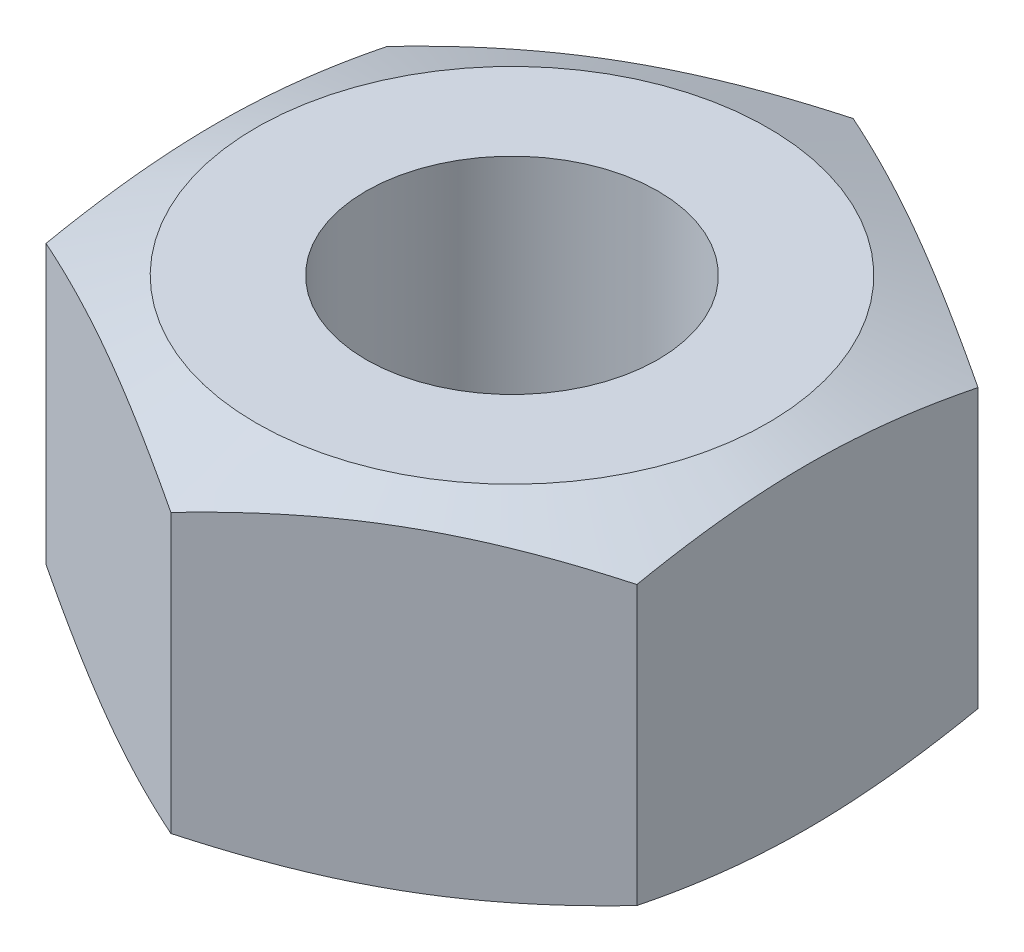
ISO-10303-21;
HEADER;
FILE_DESCRIPTION(('STEP AP214'),'2;1');
FILE_NAME('part.step','',(''),(''),'','','');
FILE_SCHEMA(('AUTOMOTIVE_DESIGN { 1 0 10303 214 1 1 1 1 }'));
ENDSEC;
DATA;
#1=APPLICATION_CONTEXT('core data for automotive mechanical design processes');
#2=APPLICATION_PROTOCOL_DEFINITION('international standard','automotive_design',2000,#1);
#3=PRODUCT_CONTEXT('',#1,'mechanical');
#4=PRODUCT('Part','Part','',(#3));
#5=PRODUCT_RELATED_PRODUCT_CATEGORY('part','',(#4));
#6=PRODUCT_DEFINITION_FORMATION('','',#4);
#7=PRODUCT_DEFINITION_CONTEXT('part definition',#1,'design');
#8=PRODUCT_DEFINITION('design','',#6,#7);
#9=PRODUCT_DEFINITION_SHAPE('','',#8);
#10=(LENGTH_UNIT() NAMED_UNIT(*) SI_UNIT(.MILLI.,.METRE.));
#11=(NAMED_UNIT(*) PLANE_ANGLE_UNIT() SI_UNIT($,.RADIAN.));
#12=(NAMED_UNIT(*) SI_UNIT($,.STERADIAN.) SOLID_ANGLE_UNIT());
#13=UNCERTAINTY_MEASURE_WITH_UNIT(LENGTH_MEASURE(1.E-05),#10,'distance_accuracy_value','');
#14=(GEOMETRIC_REPRESENTATION_CONTEXT(3) GLOBAL_UNCERTAINTY_ASSIGNED_CONTEXT((#13)) GLOBAL_UNIT_ASSIGNED_CONTEXT((#10,
#11,#12)) REPRESENTATION_CONTEXT('',''));
#15=CARTESIAN_POINT('',(0.,0.,0.));
#16=DIRECTION('',(0.,0.,1.));
#17=DIRECTION('',(1.,0.,0.));
#18=AXIS2_PLACEMENT_3D('',#15,#16,#17);
#19=CARTESIAN_POINT('',(0.,10.,0.));
#20=DIRECTION('',(0.,1.,0.));
#21=DIRECTION('',(0.,0.,1.));
#22=AXIS2_PLACEMENT_3D('',#19,#20,#21);
#23=PLANE('',#22);
#24=CARTESIAN_POINT('',(0.,10.,0.));
#25=DIRECTION('',(0.,1.,0.));
#26=DIRECTION('',(0.,0.,1.));
#27=AXIS2_PLACEMENT_3D('',#24,#25,#26);
#28=CIRCLE('',#27,4.2);
#29=CARTESIAN_POINT('',(0.,10.,4.2));
#30=VERTEX_POINT('',#29);
#31=EDGE_CURVE('E204',#30,#30,#28,.T.);
#32=ORIENTED_EDGE('',*,*,#31,.F.);
#33=EDGE_LOOP('',(#32));
#34=FACE_BOUND('',#33,.T.);
#35=CARTESIAN_POINT('',(0.,10.,0.));
#36=DIRECTION('',(0.,1.,0.));
#37=DIRECTION('',(0.,0.,1.));
#38=AXIS2_PLACEMENT_3D('',#35,#36,#37);
#39=CIRCLE('',#38,7.36121593216768);
#40=CARTESIAN_POINT('',(0.,10.,7.36121593216768));
#41=VERTEX_POINT('',#40);
#42=EDGE_CURVE('E244',#41,#41,#39,.T.);
#43=ORIENTED_EDGE('',*,*,#42,.T.);
#44=EDGE_LOOP('',(#43));
#45=FACE_BOUND('',#44,.T.);
#46=ADVANCED_FACE('F34',(#34,#45),#23,.T.);
#47=CARTESIAN_POINT('',(0.,0.,0.));
#48=DIRECTION('',(0.,1.,0.));
#49=DIRECTION('',(0.,0.,1.));
#50=AXIS2_PLACEMENT_3D('',#47,#48,#49);
#51=PLANE('',#50);
#52=CARTESIAN_POINT('',(0.,0.,0.));
#53=DIRECTION('',(0.,1.,0.));
#54=DIRECTION('',(0.,0.,1.));
#55=AXIS2_PLACEMENT_3D('',#52,#53,#54);
#56=CIRCLE('',#55,7.36121593216768);
#57=CARTESIAN_POINT('',(0.,0.,7.36121593216768));
#58=VERTEX_POINT('',#57);
#59=EDGE_CURVE('E108',#58,#58,#56,.T.);
#60=ORIENTED_EDGE('',*,*,#59,.F.);
#61=EDGE_LOOP('',(#60));
#62=FACE_BOUND('',#61,.T.);
#63=CARTESIAN_POINT('',(0.,0.,0.));
#64=DIRECTION('',(0.,1.,0.));
#65=DIRECTION('',(0.,0.,1.));
#66=AXIS2_PLACEMENT_3D('',#63,#64,#65);
#67=CIRCLE('',#66,4.2);
#68=CARTESIAN_POINT('',(0.,0.,4.2));
#69=VERTEX_POINT('',#68);
#70=EDGE_CURVE('E203',#69,#69,#67,.T.);
#71=ORIENTED_EDGE('',*,*,#70,.T.);
#72=EDGE_LOOP('',(#71));
#73=FACE_BOUND('',#72,.T.);
#74=ADVANCED_FACE('F234',(#62,#73),#51,.F.);
#75=CARTESIAN_POINT('',(0.,10.,0.));
#76=DIRECTION('',(0.,-1.,0.));
#77=DIRECTION('',(0.,0.,-1.));
#78=AXIS2_PLACEMENT_3D('',#75,#76,#77);
#79=CYLINDRICAL_SURFACE('',#78,4.2);
#80=ORIENTED_EDGE('',*,*,#31,.T.);
#81=EDGE_LOOP('',(#80));
#82=FACE_BOUND('',#81,.T.);
#83=ORIENTED_EDGE('',*,*,#70,.F.);
#84=EDGE_LOOP('',(#83));
#85=FACE_BOUND('',#84,.T.);
#86=ADVANCED_FACE('F138',(#82,#85),#79,.F.);
#87=CARTESIAN_POINT('',(0.,9.,0.));
#88=DIRECTION('',(0.,-1.,0.));
#89=DIRECTION('',(0.,0.,-1.));
#90=AXIS2_PLACEMENT_3D('',#87,#88,#89);
#91=CONICAL_SURFACE('',#90,9.81495457622363,1.18380572483131);
#92=ORIENTED_EDGE('',*,*,#42,.F.);
#93=EDGE_LOOP('',(#92));
#94=FACE_BOUND('',#93,.T.);
#95=CARTESIAN_POINT('',(-8.5002,8.99995294034603,-4.90736181805796));
#96=CARTESIAN_POINT('',(-8.20580195878942,9.06922887035066,-5.07733260639979));
#97=CARTESIAN_POINT('',(-7.91042568890246,9.13333560864877,-5.24786817533125));
#98=CARTESIAN_POINT('',(-7.317704581126,9.24927053537174,-5.59007586646036));
#99=CARTESIAN_POINT('',(-7.02035869750698,9.3010915554037,-5.76174859241023));
#100=CARTESIAN_POINT('',(-6.4240947440116,9.39041983407388,-6.10600174646886));
#101=CARTESIAN_POINT('',(-6.12517703336376,9.42793023046977,-6.27858196717694));
#102=CARTESIAN_POINT('',(-5.52620618349085,9.48692330235668,-6.6243979485878));
#103=CARTESIAN_POINT('',(-5.22615330654588,9.50840947707626,-6.7976335578631));
#104=CARTESIAN_POINT('',(-4.63065189291888,9.53402831778677,-7.14144645932345));
#105=CARTESIAN_POINT('',(-4.33521292155425,9.53845308535883,-7.31201822896993));
#106=CARTESIAN_POINT('',(-3.74448063948653,9.5305209166904,-7.65307767104073));
#107=CARTESIAN_POINT('',(-3.44918734347596,9.51816253884572,-7.82356533498233));
#108=CARTESIAN_POINT('',(-2.85964787389036,9.47732161660823,-8.16393610644548));
#109=CARTESIAN_POINT('',(-2.56540114280394,9.44884959817802,-8.3338195358464));
#110=CARTESIAN_POINT('',(-1.97829900561061,9.37715185322312,-8.67278311279677));
#111=CARTESIAN_POINT('',(-1.68544346542969,9.33392757892381,-8.8418633377539));
#112=CARTESIAN_POINT('',(-1.27695505725026,9.26438642632721,-9.07770423017713));
#113=CARTESIAN_POINT('',(-1.16060314150725,9.24352327314252,-9.14488004005209));
#114=CARTESIAN_POINT('',(-0.928189157489906,9.19985553530954,-9.27906431628794));
#115=CARTESIAN_POINT('',(-0.812127048196183,9.17705124356958,-9.34607280633138));
#116=CARTESIAN_POINT('',(-0.579860161078965,9.12953132955534,-9.48017215613235));
#117=CARTESIAN_POINT('',(-0.463656412995791,9.1048090242385,-9.54726242136901));
#118=CARTESIAN_POINT('',(-0.231520943678708,9.05364241756338,-9.68128589706769));
#119=CARTESIAN_POINT('',(-0.115589251774011,9.02719793865146,-9.74821909059647));
#120=CARTESIAN_POINT('',(0.000200000000001028,8.99995294034603,-9.81507004627746));
#121=B_SPLINE_CURVE_WITH_KNOTS('',3,(#95,#96,#97,#98,#99,#100,#101,#102,#103,#104,#105,#106,
#107,#108,#109,#110,#111,#112,#113,#114,#115,#116,#117,#118,#119,#120),.UNSPECIFIED.,.F.,.F.,(4,
2,2,2,2,2,2,2,2,2,2,2,4),(0.,1.04085766618028,2.08232115890739,3.12355616818027,
4.16456373508203,5.1876673690243,6.21085888898192,7.23338279661428,8.25580607508998,
8.6636824020447,9.0714972911848,9.48080315809633,9.89015129087441),.UNSPECIFIED.);
#122=CARTESIAN_POINT('',(-8.5,9.,-4.90747728811179));
#123=VERTEX_POINT('',#122);
#124=CARTESIAN_POINT('',(0.,9.,-9.81495457622363));
#125=VERTEX_POINT('',#124);
#126=EDGE_CURVE('E165',#123,#125,#121,.T.);
#127=ORIENTED_EDGE('',*,*,#126,.F.);
#128=CARTESIAN_POINT('',(-8.49999999999993,6.05378505757053,14.7734430127444));
#129=CARTESIAN_POINT('',(-8.49999999999993,6.14521584562109,14.514603711036));
#130=CARTESIAN_POINT('',(-8.49999999999993,6.23612126921899,14.2555788725807));
#131=CARTESIAN_POINT('',(-8.49999999999993,6.41672536779628,13.7371059369931));
#132=CARTESIAN_POINT('',(-8.49999999999993,6.50642403015864,13.4776578354672));
#133=CARTESIAN_POINT('',(-8.49999999999994,6.77350332564199,12.6985199757166));
#134=CARTESIAN_POINT('',(-8.49999999999994,6.9488360006149,12.1781248406069));
#135=CARTESIAN_POINT('',(-8.49999999999994,7.29392166145625,11.1301642988236));
#136=CARTESIAN_POINT('',(-8.49999999999994,7.46360840102153,10.6025769918672));
#137=CARTESIAN_POINT('',(-8.49999999999995,7.79321698073555,9.5443657322041));
#138=CARTESIAN_POINT('',(-8.49999999999995,7.95313922734329,9.01374190690326));
#139=CARTESIAN_POINT('',(-8.49999999999996,8.25523863798633,7.96426498654301));
#140=CARTESIAN_POINT('',(-8.49999999999996,8.39779870991229,7.44552316515777));
#141=CARTESIAN_POINT('',(-8.49999999999996,8.66599858479493,6.40359137594314));
#142=CARTESIAN_POINT('',(-8.49999999999996,8.79163697376346,5.88040104027126));
#143=CARTESIAN_POINT('',(-8.49999999999997,9.01959177083153,4.8309412257289));
#144=CARTESIAN_POINT('',(-8.49999999999997,9.1219964727881,4.3046914732316));
#145=CARTESIAN_POINT('',(-8.49999999999997,9.25320355777517,3.51164699878624));
#146=CARTESIAN_POINT('',(-8.49999999999997,9.29320505150899,3.24669528835192));
#147=CARTESIAN_POINT('',(-8.49999999999998,9.3648289565617,2.71566979972535));
#148=CARTESIAN_POINT('',(-8.49999999999998,9.39645208447984,2.4495961194737));
#149=CARTESIAN_POINT('',(-8.49999999999998,9.44665086965694,1.95443698666162));
#150=CARTESIAN_POINT('',(-8.49999999999998,9.46644272030804,1.72547480468039));
#151=CARTESIAN_POINT('',(-8.49999999999998,9.49883114027673,1.26705223029774));
#152=CARTESIAN_POINT('',(-8.49999999999998,9.51142817948858,1.0375918714151));
#153=CARTESIAN_POINT('',(-8.49999999999998,9.52913741126572,0.57839072972319));
#154=CARTESIAN_POINT('',(-8.49999999999998,9.53424993540711,0.348649959787915));
#155=CARTESIAN_POINT('',(-8.49999999999998,9.53686918928079,-0.110875414382304));
#156=CARTESIAN_POINT('',(-8.49999999999999,9.53437590476402,-0.340660018698564));
#157=CARTESIAN_POINT('',(-8.49999999999999,9.52183709853977,-0.800204063895981));
#158=CARTESIAN_POINT('',(-8.49999999999999,9.51178562888834,-1.0299633423507));
#159=CARTESIAN_POINT('',(-8.49999999999999,9.4843646278947,-1.48904913165291));
#160=CARTESIAN_POINT('',(-8.49999999999999,9.46699468461044,-1.71837561740939));
#161=CARTESIAN_POINT('',(-8.49999999999999,9.40445269772442,-2.40542350966656));
#162=CARTESIAN_POINT('',(-8.49999999999999,9.34884830384325,-2.86221976506699));
#163=CARTESIAN_POINT('',(-8.5,9.21387840947045,-3.77333313769236));
#164=CARTESIAN_POINT('',(-8.5,9.13445419010336,-4.22764127022451));
#165=CARTESIAN_POINT('',(-8.5,8.95659979067783,-5.13247184583842));
#166=CARTESIAN_POINT('',(-8.5,8.85816942848621,-5.58299425259893));
#167=CARTESIAN_POINT('',(-8.50000000000001,8.64643917601778,-6.48073760967403));
#168=CARTESIAN_POINT('',(-8.50000000000001,8.53313144807001,-6.92795668763914));
#169=CARTESIAN_POINT('',(-8.50000000000001,8.29508979616584,-7.81930356830697));
#170=CARTESIAN_POINT('',(-8.50000000000001,8.17035618963224,-8.26343145651755));
#171=CARTESIAN_POINT('',(-8.50000000000002,7.89161685995063,-9.21931172084533));
#172=CARTESIAN_POINT('',(-8.50000000000002,7.73610543886846,-9.7306226380255));
#173=CARTESIAN_POINT('',(-8.50000000000002,7.41637412474504,-10.7501886078263));
#174=CARTESIAN_POINT('',(-8.50000000000002,7.25215904372827,-11.2584451795671));
#175=CARTESIAN_POINT('',(-8.50000000000003,6.91842727484483,-12.2686772067257));
#176=CARTESIAN_POINT('',(-8.50000000000003,6.74896383001152,-12.7706703070888));
#177=CARTESIAN_POINT('',(-8.50000000000003,6.4909486294176,-13.5224754793111));
#178=CARTESIAN_POINT('',(-8.50000000000003,6.40428594474223,-13.7729388782824));
#179=CARTESIAN_POINT('',(-8.50000000000004,6.22984055986733,-14.2734735375754));
#180=CARTESIAN_POINT('',(-8.50000000000004,6.14205786729078,-14.5235448005531));
#181=CARTESIAN_POINT('',(-8.50000000000004,6.05378505757053,-14.7734430127443));
#182=B_SPLINE_CURVE_WITH_KNOTS('',3,(#128,#129,#130,#131,#132,#133,#134,#135,#136,#137,#138,
#139,#140,#141,#142,#143,#144,#145,#146,#147,#148,#149,#150,#151,#152,#153,#154,#155,#156,#157,
#158,#159,#160,#161,#162,#163,#164,#165,#166,#167,#168,#169,#170,#171,#172,#173,#174,#175,#176,
#177,#178,#179,#180,#181),.UNSPECIFIED.,.F.,.F.,(4,2,2,2,2,2,2,2,2,2,2,2,2,2,2,2,2,2,2,2,2,2,2,
2,2,2,4),(0.,0.823537864589147,1.64708433281094,3.2944579297063,4.95700101921851,
6.6194748560861,8.23318484576412,9.84702959467592,11.4546345796927,12.258388335858,
13.0620733249839,13.7514169274446,14.4407155036172,15.129983541825,15.8192528713383,
16.5090651925165,17.1989163470198,18.5785994394676,19.9617119782118,21.3448377717861,
22.7286951672886,24.112514129446,25.7157146971203,27.3180379601901,28.9074779412641,
29.7025740602729,30.4976647706088),.UNSPECIFIED.);
#183=CARTESIAN_POINT('',(-8.49999999999997,9.,4.90747728811185));
#184=VERTEX_POINT('',#183);
#185=EDGE_CURVE('E94',#184,#123,#182,.T.);
#186=ORIENTED_EDGE('',*,*,#185,.F.);
#187=CARTESIAN_POINT('',(0.000200000000068537,8.99995294034603,9.81507004627746));
#188=CARTESIAN_POINT('',(-0.294198041210519,9.06922887035066,9.64509925793563));
#189=CARTESIAN_POINT('',(-0.589574311097479,9.13333560864877,9.47456368900417));
#190=CARTESIAN_POINT('',(-1.18229541887394,9.24927053537174,9.13235599787506));
#191=CARTESIAN_POINT('',(-1.47964130249295,9.3010915554037,8.9606832719252));
#192=CARTESIAN_POINT('',(-2.07590525598834,9.39041983407388,8.61643011786658));
#193=CARTESIAN_POINT('',(-2.37482296663618,9.42793023046977,8.4438498971585));
#194=CARTESIAN_POINT('',(-2.9737938165091,9.48692330235668,8.09803391574764));
#195=CARTESIAN_POINT('',(-3.27384669345406,9.50840947707626,7.92479830647234));
#196=CARTESIAN_POINT('',(-3.86934810708106,9.53402831778677,7.58098540501199));
#197=CARTESIAN_POINT('',(-4.1647870784457,9.53845308535883,7.41041363536552));
#198=CARTESIAN_POINT('',(-4.75551936051342,9.5305209166904,7.06935419329472));
#199=CARTESIAN_POINT('',(-5.05081265652399,9.51816253884572,6.89886652935313));
#200=CARTESIAN_POINT('',(-5.64035212610959,9.47732161660823,6.55849575788998));
#201=CARTESIAN_POINT('',(-5.93459885719602,9.44884959817802,6.38861232848907));
#202=CARTESIAN_POINT('',(-6.52170099438935,9.37715185322313,6.0496487515387));
#203=CARTESIAN_POINT('',(-6.81455653457027,9.33392757892381,5.88056852658157));
#204=CARTESIAN_POINT('',(-7.2230449427497,9.26438642632721,5.64472763415834));
#205=CARTESIAN_POINT('',(-7.33939685849271,9.24352327314252,5.57755182428338));
#206=CARTESIAN_POINT('',(-7.57181084251005,9.19985553530954,5.44336754804754));
#207=CARTESIAN_POINT('',(-7.68787295180378,9.17705124356958,5.37635905800409));
#208=CARTESIAN_POINT('',(-7.920139838921,9.12953132955535,5.24225970820313));
#209=CARTESIAN_POINT('',(-8.03634358700417,9.1048090242385,5.17516944296647));
#210=CARTESIAN_POINT('',(-8.26847905632126,9.05364241756338,5.04114596726779));
#211=CARTESIAN_POINT('',(-8.38441074822595,9.02719793865146,4.974212773739));
#212=CARTESIAN_POINT('',(-8.50019999999997,8.99995294034603,4.90736181805801));
#213=B_SPLINE_CURVE_WITH_KNOTS('',3,(#187,#188,#189,#190,#191,#192,#193,#194,#195,#196,#197,
#198,#199,#200,#201,#202,#203,#204,#205,#206,#207,#208,#209,#210,#211,#212),.UNSPECIFIED.,.F.,
.F.,(4,2,2,2,2,2,2,2,2,2,2,2,4),(0.,1.04085766618028,2.08232115890739,3.12355616818027,
4.16456373508203,5.1876673690243,6.21085888898191,7.23338279661427,8.25580607508997,
8.6636824020447,9.07149729118479,9.48080315809633,9.8901512908744),.UNSPECIFIED.);
#214=CARTESIAN_POINT('',(0.,9.,9.81495457622363));
#215=VERTEX_POINT('',#214);
#216=EDGE_CURVE('E91',#215,#184,#213,.T.);
#217=ORIENTED_EDGE('',*,*,#216,.F.);
#218=CARTESIAN_POINT('',(8.50020000000003,8.99995294034603,4.9073618180579));
#219=CARTESIAN_POINT('',(8.20580195878945,9.06922887035066,5.07733260639973));
#220=CARTESIAN_POINT('',(7.91042568890249,9.13333560864878,5.24786817533119));
#221=CARTESIAN_POINT('',(7.31770458112603,9.24927053537174,5.59007586646031));
#222=CARTESIAN_POINT('',(7.02035869750702,9.3010915554037,5.76174859241018));
#223=CARTESIAN_POINT('',(6.42409474401165,9.39041983407388,6.10600174646881));
#224=CARTESIAN_POINT('',(6.1251770333638,9.42793023046977,6.27858196717689));
#225=CARTESIAN_POINT('',(5.52620618349089,9.48692330235668,6.62439794858776));
#226=CARTESIAN_POINT('',(5.22615330654593,9.50840947707626,6.79763355786306));
#227=CARTESIAN_POINT('',(4.63065189291893,9.53402831778677,7.14144645932342));
#228=CARTESIAN_POINT('',(4.3352129215543,9.53845308535883,7.3120182289699));
#229=CARTESIAN_POINT('',(3.74448063948659,9.5305209166904,7.6530776710407));
#230=CARTESIAN_POINT('',(3.44918734347601,9.51816253884572,7.8235653349823));
#231=CARTESIAN_POINT('',(2.85964787389042,9.47732161660823,8.16393610644546));
#232=CARTESIAN_POINT('',(2.565401142804,9.44884959817802,8.33381953584638));
#233=CARTESIAN_POINT('',(1.97829900561067,9.37715185322313,8.67278311279675));
#234=CARTESIAN_POINT('',(1.68544346542975,9.33392757892381,8.84186333775388));
#235=CARTESIAN_POINT('',(1.27695505725032,9.26438642632721,9.07770423017712));
#236=CARTESIAN_POINT('',(1.16060314150731,9.24352327314252,9.14488004005208));
#237=CARTESIAN_POINT('',(0.928189157489973,9.19985553530954,9.27906431628793));
#238=CARTESIAN_POINT('',(0.812127048196251,9.17705124356958,9.34607280633137));
#239=CARTESIAN_POINT('',(0.579860161079035,9.12953132955535,9.48017215613234));
#240=CARTESIAN_POINT('',(0.463656412995861,9.1048090242385,9.547262421369));
#241=CARTESIAN_POINT('',(0.231520943678779,9.05364241756338,9.68128589706768));
#242=CARTESIAN_POINT('',(0.115589251774081,9.02719793865146,9.74821909059647));
#243=CARTESIAN_POINT('',(-0.000199999999930704,8.99995294034603,9.81507004627746));
#244=B_SPLINE_CURVE_WITH_KNOTS('',3,(#218,#219,#220,#221,#222,#223,#224,#225,#226,#227,#228,
#229,#230,#231,#232,#233,#234,#235,#236,#237,#238,#239,#240,#241,#242,#243),.UNSPECIFIED.,.F.,
.F.,(4,2,2,2,2,2,2,2,2,2,2,2,4),(0.,1.04085766618028,2.08232115890739,3.12355616818027,
4.16456373508203,5.1876673690243,6.21085888898192,7.23338279661427,8.25580607508997,
8.6636824020447,9.07149729118479,9.48080315809633,9.8901512908744),.UNSPECIFIED.);
#245=CARTESIAN_POINT('',(8.50000000000003,9.,4.90747728811173));
#246=VERTEX_POINT('',#245);
#247=EDGE_CURVE('E56',#246,#215,#244,.T.);
#248=ORIENTED_EDGE('',*,*,#247,.F.);
#249=CARTESIAN_POINT('',(8.49999999999983,6.05378505757053,-14.7734430127444));
#250=CARTESIAN_POINT('',(8.49999999999983,6.14521584562109,-14.514603711036));
#251=CARTESIAN_POINT('',(8.49999999999983,6.23612126921899,-14.2555788725808));
#252=CARTESIAN_POINT('',(8.49999999999984,6.41672536779628,-13.7371059369932));
#253=CARTESIAN_POINT('',(8.49999999999984,6.50642403015864,-13.4776578354672));
#254=CARTESIAN_POINT('',(8.49999999999985,6.77350332564199,-12.6985199757166));
#255=CARTESIAN_POINT('',(8.49999999999985,6.9488360006149,-12.178124840607));
#256=CARTESIAN_POINT('',(8.49999999999986,7.29392166145625,-11.1301642988237));
#257=CARTESIAN_POINT('',(8.49999999999987,7.46360840102153,-10.6025769918672));
#258=CARTESIAN_POINT('',(8.49999999999988,7.79321698073555,-9.54436573220415));
#259=CARTESIAN_POINT('',(8.49999999999989,7.95313922734329,-9.01374190690331));
#260=CARTESIAN_POINT('',(8.4999999999999,8.25523863798634,-7.96426498654306));
#261=CARTESIAN_POINT('',(8.49999999999991,8.39779870991229,-7.44552316515783));
#262=CARTESIAN_POINT('',(8.49999999999991,8.66599858479493,-6.4035913759432));
#263=CARTESIAN_POINT('',(8.49999999999992,8.79163697376346,-5.88040104027132));
#264=CARTESIAN_POINT('',(8.49999999999993,9.01959177083153,-4.83094122572896));
#265=CARTESIAN_POINT('',(8.49999999999994,9.12199647278811,-4.30469147323166));
#266=CARTESIAN_POINT('',(8.49999999999995,9.25320355777517,-3.5116469987863));
#267=CARTESIAN_POINT('',(8.49999999999995,9.29320505150899,-3.24669528835198));
#268=CARTESIAN_POINT('',(8.49999999999995,9.3648289565617,-2.71566979972541));
#269=CARTESIAN_POINT('',(8.49999999999996,9.39645208447984,-2.44959611947376));
#270=CARTESIAN_POINT('',(8.49999999999996,9.44665086965694,-1.95443698666168));
#271=CARTESIAN_POINT('',(8.49999999999996,9.46644272030804,-1.72547480468045));
#272=CARTESIAN_POINT('',(8.49999999999997,9.49883114027673,-1.2670522302978));
#273=CARTESIAN_POINT('',(8.49999999999997,9.51142817948858,-1.03759187141516));
#274=CARTESIAN_POINT('',(8.49999999999998,9.52913741126572,-0.57839072972325));
#275=CARTESIAN_POINT('',(8.49999999999998,9.53424993540711,-0.348649959787975));
#276=CARTESIAN_POINT('',(8.49999999999998,9.53686918928079,0.110875414382244));
#277=CARTESIAN_POINT('',(8.49999999999999,9.53437590476402,0.340660018698503));
#278=CARTESIAN_POINT('',(8.49999999999999,9.52183709853977,0.800204063895918));
#279=CARTESIAN_POINT('',(8.49999999999999,9.51178562888834,1.02996334235063));
#280=CARTESIAN_POINT('',(8.5,9.4843646278947,1.48904913165285));
#281=CARTESIAN_POINT('',(8.5,9.46699468461044,1.71837561740933));
#282=CARTESIAN_POINT('',(8.50000000000001,9.40445269772442,2.4054235096665));
#283=CARTESIAN_POINT('',(8.50000000000001,9.34884830384325,2.86221976506693));
#284=CARTESIAN_POINT('',(8.50000000000002,9.21387840947045,3.7733331376923));
#285=CARTESIAN_POINT('',(8.50000000000003,9.13445419010336,4.22764127022445));
#286=CARTESIAN_POINT('',(8.50000000000004,8.95659979067783,5.13247184583836));
#287=CARTESIAN_POINT('',(8.50000000000004,8.85816942848621,5.58299425259887));
#288=CARTESIAN_POINT('',(8.50000000000005,8.64643917601778,6.48073760967397));
#289=CARTESIAN_POINT('',(8.50000000000006,8.53313144807001,6.92795668763908));
#290=CARTESIAN_POINT('',(8.50000000000006,8.29508979616584,7.81930356830691));
#291=CARTESIAN_POINT('',(8.50000000000007,8.17035618963224,8.26343145651749));
#292=CARTESIAN_POINT('',(8.50000000000008,7.89161685995063,9.21931172084527));
#293=CARTESIAN_POINT('',(8.50000000000008,7.73610543886846,9.73062263802545));
#294=CARTESIAN_POINT('',(8.50000000000009,7.41637412474504,10.7501886078263));
#295=CARTESIAN_POINT('',(8.5000000000001,7.25215904372827,11.2584451795671));
#296=CARTESIAN_POINT('',(8.50000000000011,6.91842727484482,12.2686772067256));
#297=CARTESIAN_POINT('',(8.50000000000012,6.74896383001152,12.7706703070887));
#298=CARTESIAN_POINT('',(8.50000000000012,6.4909486294176,13.5224754793111));
#299=CARTESIAN_POINT('',(8.50000000000013,6.40428594474223,13.7729388782823));
#300=CARTESIAN_POINT('',(8.50000000000013,6.22984055986733,14.2734735375753));
#301=CARTESIAN_POINT('',(8.50000000000014,6.14205786729078,14.523544800553));
#302=CARTESIAN_POINT('',(8.50000000000014,6.05378505757053,14.7734430127442));
#303=B_SPLINE_CURVE_WITH_KNOTS('',3,(#249,#250,#251,#252,#253,#254,#255,#256,#257,#258,#259,
#260,#261,#262,#263,#264,#265,#266,#267,#268,#269,#270,#271,#272,#273,#274,#275,#276,#277,#278,
#279,#280,#281,#282,#283,#284,#285,#286,#287,#288,#289,#290,#291,#292,#293,#294,#295,#296,#297,
#298,#299,#300,#301,#302),.UNSPECIFIED.,.F.,.F.,(4,2,2,2,2,2,2,2,2,2,2,2,2,2,2,2,2,2,2,2,2,2,2,
2,2,2,4),(0.,0.823537864589148,1.64708433281094,3.2944579297063,4.95700101921851,
6.61947485608611,8.23318484576412,9.84702959467592,11.4546345796927,12.258388335858,
13.0620733249839,13.7514169274446,14.4407155036172,15.129983541825,15.8192528713383,
16.5090651925165,17.1989163470198,18.5785994394676,19.9617119782118,21.3448377717861,
22.7286951672886,24.112514129446,25.7157146971204,27.3180379601901,28.9074779412641,
29.7025740602729,30.4976647706088),.UNSPECIFIED.);
#304=CARTESIAN_POINT('',(8.49999999999993,9.,-4.90747728811191));
#305=VERTEX_POINT('',#304);
#306=EDGE_CURVE('E49',#305,#246,#303,.T.);
#307=ORIENTED_EDGE('',*,*,#306,.F.);
#308=CARTESIAN_POINT('',(-0.000199999999999592,8.99995294034603,-9.81507004627746));
#309=CARTESIAN_POINT('',(0.294198041210586,9.06922887035066,-9.64509925793564));
#310=CARTESIAN_POINT('',(0.589574311097546,9.13333560864877,-9.47456368900417));
#311=CARTESIAN_POINT('',(1.18229541887401,9.24927053537174,-9.13235599787506));
#312=CARTESIAN_POINT('',(1.47964130249302,9.30109155540369,-8.96068327192521));
#313=CARTESIAN_POINT('',(2.0759052559884,9.39041983407387,-8.61643011786658));
#314=CARTESIAN_POINT('',(2.37482296663625,9.42793023046976,-8.4438498971585));
#315=CARTESIAN_POINT('',(2.97379381650916,9.48692330235667,-8.09803391574764));
#316=CARTESIAN_POINT('',(3.27384669345412,9.50840947707625,-7.92479830647235));
#317=CARTESIAN_POINT('',(3.86934810708113,9.53402831778675,-7.580985405012));
#318=CARTESIAN_POINT('',(4.16478707844576,9.53845308535881,-7.41041363536552));
#319=CARTESIAN_POINT('',(4.75551936051348,9.53052091669038,-7.06935419329473));
#320=CARTESIAN_POINT('',(5.05081265652405,9.5181625388457,-6.89886652935313));
#321=CARTESIAN_POINT('',(5.64035212610965,9.47732161660821,-6.55849575788998));
#322=CARTESIAN_POINT('',(5.93459885719607,9.448849598178,-6.38861232848907));
#323=CARTESIAN_POINT('',(6.5217009943894,9.37715185322311,-6.0496487515387));
#324=CARTESIAN_POINT('',(6.81455653457032,9.33392757892379,-5.88056852658158));
#325=CARTESIAN_POINT('',(7.22304494274975,9.26438642632719,-5.64472763415835));
#326=CARTESIAN_POINT('',(7.33939685849275,9.24352327314251,-5.5775518242834));
#327=CARTESIAN_POINT('',(7.57181084251008,9.19985553530953,-5.44336754804756));
#328=CARTESIAN_POINT('',(7.68787295180379,9.17705124356957,-5.37635905800412));
#329=CARTESIAN_POINT('',(7.920139838921,9.12953132955534,-5.24225970820317));
#330=CARTESIAN_POINT('',(8.03634358700416,9.10480902423849,-5.17516944296651));
#331=CARTESIAN_POINT('',(8.26847905632123,9.05364241756338,-5.04114596726784));
#332=CARTESIAN_POINT('',(8.38441074822593,9.02719793865146,-4.97421277373906));
#333=CARTESIAN_POINT('',(8.50019999999993,8.99995294034603,-4.90736181805807));
#334=B_SPLINE_CURVE_WITH_KNOTS('',3,(#308,#309,#310,#311,#312,#313,#314,#315,#316,#317,#318,
#319,#320,#321,#322,#323,#324,#325,#326,#327,#328,#329,#330,#331,#332,#333),.UNSPECIFIED.,.F.,
.F.,(4,2,2,2,2,2,2,2,2,2,2,2,4),(0.,1.04085766618028,2.08232115890738,3.12355616818026,
4.16456373508202,5.18766736902429,6.2108588889819,7.23338279661426,8.25580607508996,
8.66368240204465,9.07149729118472,9.48080315809623,9.89015129087428),.UNSPECIFIED.);
#335=EDGE_CURVE('E171',#125,#305,#334,.T.);
#336=ORIENTED_EDGE('',*,*,#335,.F.);
#337=EDGE_LOOP('',(#127,#186,#217,#248,#307,#336));
#338=FACE_BOUND('',#337,.T.);
#339=ADVANCED_FACE('F92',(#94,#338),#91,.T.);
#340=CARTESIAN_POINT('',(0.,0.999999999999999,0.));
#341=DIRECTION('',(0.,1.,0.));
#342=DIRECTION('',(0.,0.,1.));
#343=AXIS2_PLACEMENT_3D('',#340,#341,#342);
#344=CONICAL_SURFACE('',#343,9.81495457622363,1.18380572483131);
#345=ORIENTED_EDGE('',*,*,#59,.T.);
#346=EDGE_LOOP('',(#345));
#347=FACE_BOUND('',#346,.T.);
#348=CARTESIAN_POINT('',(-0.000199999999999565,1.00004705965397,-9.81507004627746));
#349=CARTESIAN_POINT('',(0.294198041210587,0.930771129649339,-9.64509925793564));
#350=CARTESIAN_POINT('',(0.589574311097545,0.866664391351226,-9.47456368900417));
#351=CARTESIAN_POINT('',(1.182295418874,0.750729464628263,-9.13235599787507));
#352=CARTESIAN_POINT('',(1.47964130249302,0.698908444596308,-8.96068327192521));
#353=CARTESIAN_POINT('',(2.0759052559884,0.609580165926125,-8.61643011786658));
#354=CARTESIAN_POINT('',(2.37482296663624,0.572069769530238,-8.4438498971585));
#355=CARTESIAN_POINT('',(2.97379381650916,0.513076697643329,-8.09803391574764));
#356=CARTESIAN_POINT('',(3.27384669345412,0.491590522923754,-7.92479830647235));
#357=CARTESIAN_POINT('',(3.86934810708112,0.465971682213243,-7.580985405012));
#358=CARTESIAN_POINT('',(4.16478707844576,0.461546914641185,-7.41041363536553));
#359=CARTESIAN_POINT('',(4.75551936051347,0.469479083309617,-7.06935419329473));
#360=CARTESIAN_POINT('',(5.05081265652405,0.481837461154296,-6.89886652935314));
#361=CARTESIAN_POINT('',(5.64035212610965,0.522678383391789,-6.55849575788999));
#362=CARTESIAN_POINT('',(5.93459885719607,0.551150401821996,-6.38861232848908));
#363=CARTESIAN_POINT('',(6.5217009943894,0.622848146776891,-6.04964875153871));
#364=CARTESIAN_POINT('',(6.81455653457032,0.666072421076204,-5.88056852658158));
#365=CARTESIAN_POINT('',(7.22304494274974,0.73561357367281,-5.64472763415835));
#366=CARTESIAN_POINT('',(7.33939685849275,0.756476726857491,-5.5775518242834));
#367=CARTESIAN_POINT('',(7.57181084251007,0.800144464690473,-5.44336754804757));
#368=CARTESIAN_POINT('',(7.68787295180379,0.82294875643043,-5.37635905800412));
#369=CARTESIAN_POINT('',(7.92013983892099,0.870468670444663,-5.24225970820317));
#370=CARTESIAN_POINT('',(8.03634358700416,0.895190975761511,-5.17516944296651));
#371=CARTESIAN_POINT('',(8.26847905632123,0.94635758243662,-5.04114596726784));
#372=CARTESIAN_POINT('',(8.38441074822593,0.972802061348543,-4.97421277373906));
#373=CARTESIAN_POINT('',(8.50019999999993,1.00004705965397,-4.90736181805807));
#374=B_SPLINE_CURVE_WITH_KNOTS('',3,(#348,#349,#350,#351,#352,#353,#354,#355,#356,#357,#358,
#359,#360,#361,#362,#363,#364,#365,#366,#367,#368,#369,#370,#371,#372,#373),.UNSPECIFIED.,.F.,
.F.,(4,2,2,2,2,2,2,2,2,2,2,2,4),(0.,1.04085766618027,2.08232115890738,3.12355616818026,
4.16456373508202,5.18766736902429,6.2108588889819,7.23338279661425,8.25580607508995,
8.66368240204465,9.07149729118472,9.48080315809624,9.89015129087429),.UNSPECIFIED.);
#375=CARTESIAN_POINT('',(0.,0.999999999999999,-9.81495457622363));
#376=VERTEX_POINT('',#375);
#377=CARTESIAN_POINT('',(8.49999999999993,0.999999999999999,-4.90747728811191));
#378=VERTEX_POINT('',#377);
#379=EDGE_CURVE('E63',#376,#378,#374,.T.);
#380=ORIENTED_EDGE('',*,*,#379,.T.);
#381=CARTESIAN_POINT('',(8.49999999999983,3.94621494242948,-14.7734430127444));
#382=CARTESIAN_POINT('',(8.49999999999983,3.85478415437891,-14.514603711036));
#383=CARTESIAN_POINT('',(8.49999999999983,3.76387873078101,-14.2555788725808));
#384=CARTESIAN_POINT('',(8.49999999999984,3.58327463220373,-13.7371059369932));
#385=CARTESIAN_POINT('',(8.49999999999984,3.49357596984136,-13.4776578354672));
#386=CARTESIAN_POINT('',(8.49999999999985,3.22649667435801,-12.6985199757166));
#387=CARTESIAN_POINT('',(8.49999999999985,3.0511639993851,-12.178124840607));
#388=CARTESIAN_POINT('',(8.49999999999986,2.70607833854375,-11.1301642988237));
#389=CARTESIAN_POINT('',(8.49999999999987,2.53639159897847,-10.6025769918672));
#390=CARTESIAN_POINT('',(8.49999999999988,2.20678301926446,-9.54436573220417));
#391=CARTESIAN_POINT('',(8.49999999999989,2.04686077265671,-9.01374190690333));
#392=CARTESIAN_POINT('',(8.4999999999999,1.74476136201367,-7.96426498654308));
#393=CARTESIAN_POINT('',(8.49999999999991,1.60220129008771,-7.44552316515784));
#394=CARTESIAN_POINT('',(8.49999999999991,1.33400141520508,-6.40359137594321));
#395=CARTESIAN_POINT('',(8.49999999999992,1.20836302623654,-5.88040104027133));
#396=CARTESIAN_POINT('',(8.49999999999993,0.980408229168471,-4.83094122572897));
#397=CARTESIAN_POINT('',(8.49999999999994,0.878003527211895,-4.30469147323167));
#398=CARTESIAN_POINT('',(8.49999999999995,0.746796442224827,-3.51164699878631));
#399=CARTESIAN_POINT('',(8.49999999999995,0.706794948491008,-3.24669528835199));
#400=CARTESIAN_POINT('',(8.49999999999995,0.635171043438301,-2.71566979972542));
#401=CARTESIAN_POINT('',(8.49999999999996,0.603547915520161,-2.44959611947377));
#402=CARTESIAN_POINT('',(8.49999999999996,0.553349130343062,-1.9544369866617));
#403=CARTESIAN_POINT('',(8.49999999999996,0.53355727969196,-1.72547480468046));
#404=CARTESIAN_POINT('',(8.49999999999997,0.501168859723269,-1.26705223029782));
#405=CARTESIAN_POINT('',(8.49999999999997,0.488571820511417,-1.03759187141517));
#406=CARTESIAN_POINT('',(8.49999999999998,0.470862588734281,-0.57839072972327));
#407=CARTESIAN_POINT('',(8.49999999999998,0.465750064592888,-0.348649959787995));
#408=CARTESIAN_POINT('',(8.49999999999998,0.463130810719207,0.110875414382223));
#409=CARTESIAN_POINT('',(8.49999999999999,0.465624095235974,0.340660018698481));
#410=CARTESIAN_POINT('',(8.49999999999999,0.478162901460232,0.800204063895895));
#411=CARTESIAN_POINT('',(8.49999999999999,0.488214371111654,1.02996334235061));
#412=CARTESIAN_POINT('',(8.5,0.515635372105296,1.48904913165282));
#413=CARTESIAN_POINT('',(8.5,0.533005315389554,1.71837561740931));
#414=CARTESIAN_POINT('',(8.50000000000001,0.59554730227558,2.40542350966648));
#415=CARTESIAN_POINT('',(8.50000000000001,0.65115169615675,2.86221976506691));
#416=CARTESIAN_POINT('',(8.50000000000002,0.786121590529549,3.77333313769227));
#417=CARTESIAN_POINT('',(8.50000000000003,0.865545809896635,4.22764127022442));
#418=CARTESIAN_POINT('',(8.50000000000004,1.04340020932216,5.13247184583833));
#419=CARTESIAN_POINT('',(8.50000000000004,1.14183057151378,5.58299425259884));
#420=CARTESIAN_POINT('',(8.50000000000005,1.35356082398221,6.48073760967393));
#421=CARTESIAN_POINT('',(8.50000000000006,1.46686855192998,6.92795668763905));
#422=CARTESIAN_POINT('',(8.50000000000006,1.70491020383415,7.81930356830687));
#423=CARTESIAN_POINT('',(8.50000000000007,1.82964381036775,8.26343145651745));
#424=CARTESIAN_POINT('',(8.50000000000008,2.10838314004936,9.21931172084523));
#425=CARTESIAN_POINT('',(8.50000000000008,2.26389456113153,9.73062263802541));
#426=CARTESIAN_POINT('',(8.50000000000009,2.58362587525495,10.7501886078262));
#427=CARTESIAN_POINT('',(8.5000000000001,2.74784095627173,11.258445179567));
#428=CARTESIAN_POINT('',(8.50000000000011,3.08157272515517,12.2686772067256));
#429=CARTESIAN_POINT('',(8.50000000000012,3.25103616998848,12.7706703070887));
#430=CARTESIAN_POINT('',(8.50000000000012,3.5090513705824,13.522475479311));
#431=CARTESIAN_POINT('',(8.50000000000013,3.59571405525777,13.7729388782823));
#432=CARTESIAN_POINT('',(8.50000000000013,3.77015944013267,14.2734735375753));
#433=CARTESIAN_POINT('',(8.50000000000014,3.85794213270922,14.523544800553));
#434=CARTESIAN_POINT('',(8.50000000000014,3.94621494242948,14.7734430127442));
#435=B_SPLINE_CURVE_WITH_KNOTS('',3,(#381,#382,#383,#384,#385,#386,#387,#388,#389,#390,#391,
#392,#393,#394,#395,#396,#397,#398,#399,#400,#401,#402,#403,#404,#405,#406,#407,#408,#409,#410,
#411,#412,#413,#414,#415,#416,#417,#418,#419,#420,#421,#422,#423,#424,#425,#426,#427,#428,#429,
#430,#431,#432,#433,#434),.UNSPECIFIED.,.F.,.F.,(4,2,2,2,2,2,2,2,2,2,2,2,2,2,2,2,2,2,2,2,2,2,2,
2,2,2,4),(0.,0.823537864589145,1.64708433281094,3.29445792970629,4.9570010192185,
6.61947485608609,8.23318484576411,9.84702959467591,11.4546345796927,12.258388335858,
13.0620733249839,13.7514169274446,14.4407155036172,15.1299835418249,15.8192528713383,
16.5090651925165,17.1989163470198,18.5785994394675,19.9617119782117,21.3448377717861,
22.7286951672886,24.112514129446,25.7157146971203,27.3180379601901,28.907477941264,
29.7025740602729,30.4976647706088),.UNSPECIFIED.);
#436=CARTESIAN_POINT('',(8.50000000000003,0.999999999999999,4.90747728811174));
#437=VERTEX_POINT('',#436);
#438=EDGE_CURVE('E11',#378,#437,#435,.T.);
#439=ORIENTED_EDGE('',*,*,#438,.T.);
#440=CARTESIAN_POINT('',(8.50020000000003,1.00004705965397,4.9073618180579));
#441=CARTESIAN_POINT('',(8.20580195878945,0.930771129649337,5.07733260639973));
#442=CARTESIAN_POINT('',(7.91042568890249,0.866664391351223,5.24786817533119));
#443=CARTESIAN_POINT('',(7.31770458112604,0.750729464628258,5.59007586646031));
#444=CARTESIAN_POINT('',(7.02035869750702,0.698908444596302,5.76174859241018));
#445=CARTESIAN_POINT('',(6.42409474401165,0.609580165926117,6.10600174646881));
#446=CARTESIAN_POINT('',(6.1251770333638,0.572069769530228,6.27858196717689));
#447=CARTESIAN_POINT('',(5.52620618349089,0.513076697643318,6.62439794858776));
#448=CARTESIAN_POINT('',(5.22615330654593,0.491590522923742,6.79763355786306));
#449=CARTESIAN_POINT('',(4.63065189291894,0.465971682213229,7.14144645932342));
#450=CARTESIAN_POINT('',(4.3352129215543,0.46154691464117,7.3120182289699));
#451=CARTESIAN_POINT('',(3.74448063948659,0.469479083309601,7.6530776710407));
#452=CARTESIAN_POINT('',(3.44918734347601,0.48183746115428,7.8235653349823));
#453=CARTESIAN_POINT('',(2.85964787389042,0.522678383391772,8.16393610644546));
#454=CARTESIAN_POINT('',(2.565401142804,0.551150401821978,8.33381953584637));
#455=CARTESIAN_POINT('',(1.97829900561067,0.622848146776873,8.67278311279675));
#456=CARTESIAN_POINT('',(1.68544346542976,0.666072421076185,8.84186333775388));
#457=CARTESIAN_POINT('',(1.27695505725033,0.735613573672792,9.07770423017712));
#458=CARTESIAN_POINT('',(1.16060314150732,0.756476726857475,9.14488004005208));
#459=CARTESIAN_POINT('',(0.928189157489976,0.80014446469046,9.27906431628793));
#460=CARTESIAN_POINT('',(0.812127048196253,0.822948756430417,9.34607280633137));
#461=CARTESIAN_POINT('',(0.579860161079035,0.870468670444653,9.48017215613234));
#462=CARTESIAN_POINT('',(0.463656412995861,0.895190975761503,9.547262421369));
#463=CARTESIAN_POINT('',(0.231520943678778,0.946357582436617,9.68128589706768));
#464=CARTESIAN_POINT('',(0.11558925177408,0.972802061348541,9.74821909059647));
#465=CARTESIAN_POINT('',(-0.000199999999930891,1.00004705965397,9.81507004627746));
#466=B_SPLINE_CURVE_WITH_KNOTS('',3,(#440,#441,#442,#443,#444,#445,#446,#447,#448,#449,#450,
#451,#452,#453,#454,#455,#456,#457,#458,#459,#460,#461,#462,#463,#464,#465),.UNSPECIFIED.,.F.,
.F.,(4,2,2,2,2,2,2,2,2,2,2,2,4),(0.,1.04085766618028,2.08232115890739,3.12355616818027,
4.16456373508203,5.1876673690243,6.21085888898191,7.23338279661427,8.25580607508997,
8.66368240204469,9.07149729118479,9.48080315809633,9.8901512908744),.UNSPECIFIED.);
#467=CARTESIAN_POINT('',(0.,0.999999999999999,9.81495457622363));
#468=VERTEX_POINT('',#467);
#469=EDGE_CURVE('E214',#437,#468,#466,.T.);
#470=ORIENTED_EDGE('',*,*,#469,.T.);
#471=CARTESIAN_POINT('',(0.000200000000068537,1.00004705965397,9.81507004627746));
#472=CARTESIAN_POINT('',(-0.294198041210519,0.930771129649338,9.64509925793563));
#473=CARTESIAN_POINT('',(-0.589574311097479,0.866664391351224,9.47456368900417));
#474=CARTESIAN_POINT('',(-1.18229541887394,0.750729464628258,9.13235599787506));
#475=CARTESIAN_POINT('',(-1.47964130249295,0.698908444596302,8.9606832719252));
#476=CARTESIAN_POINT('',(-2.07590525598833,0.609580165926117,8.61643011786658));
#477=CARTESIAN_POINT('',(-2.37482296663618,0.572069769530229,8.4438498971585));
#478=CARTESIAN_POINT('',(-2.97379381650909,0.513076697643319,8.09803391574764));
#479=CARTESIAN_POINT('',(-3.27384669345406,0.491590522923743,7.92479830647234));
#480=CARTESIAN_POINT('',(-3.86934810708106,0.46597168221323,7.580985405012));
#481=CARTESIAN_POINT('',(-4.1647870784457,0.461546914641171,7.41041363536552));
#482=CARTESIAN_POINT('',(-4.75551936051342,0.469479083309602,7.06935419329472));
#483=CARTESIAN_POINT('',(-5.05081265652399,0.48183746115428,6.89886652935313));
#484=CARTESIAN_POINT('',(-5.64035212610959,0.522678383391772,6.55849575788998));
#485=CARTESIAN_POINT('',(-5.93459885719601,0.551150401821978,6.38861232848907));
#486=CARTESIAN_POINT('',(-6.52170099438934,0.622848146776873,6.0496487515387));
#487=CARTESIAN_POINT('',(-6.81455653457026,0.666072421076184,5.88056852658157));
#488=CARTESIAN_POINT('',(-7.22304494274969,0.735613573672791,5.64472763415834));
#489=CARTESIAN_POINT('',(-7.33939685849271,0.756476726857474,5.57755182428338));
#490=CARTESIAN_POINT('',(-7.57181084251005,0.800144464690459,5.44336754804754));
#491=CARTESIAN_POINT('',(-7.68787295180377,0.822948756430417,5.37635905800409));
#492=CARTESIAN_POINT('',(-7.92013983892099,0.870468670444653,5.24225970820313));
#493=CARTESIAN_POINT('',(-8.03634358700417,0.895190975761503,5.17516944296647));
#494=CARTESIAN_POINT('',(-8.26847905632126,0.946357582436616,5.04114596726779));
#495=CARTESIAN_POINT('',(-8.38441074822595,0.972802061348541,4.974212773739));
#496=CARTESIAN_POINT('',(-8.50019999999997,1.00004705965397,4.90736181805801));
#497=B_SPLINE_CURVE_WITH_KNOTS('',3,(#471,#472,#473,#474,#475,#476,#477,#478,#479,#480,#481,
#482,#483,#484,#485,#486,#487,#488,#489,#490,#491,#492,#493,#494,#495,#496),.UNSPECIFIED.,.F.,
.F.,(4,2,2,2,2,2,2,2,2,2,2,2,4),(0.,1.04085766618028,2.08232115890739,3.12355616818027,
4.16456373508203,5.1876673690243,6.21085888898191,7.23338279661427,8.25580607508997,
8.66368240204469,9.07149729118479,9.48080315809633,9.8901512908744),.UNSPECIFIED.);
#498=CARTESIAN_POINT('',(-8.49999999999997,0.999999999999999,4.90747728811185));
#499=VERTEX_POINT('',#498);
#500=EDGE_CURVE('E112',#468,#499,#497,.T.);
#501=ORIENTED_EDGE('',*,*,#500,.T.);
#502=CARTESIAN_POINT('',(-8.49999999999993,3.94621494242947,14.7734430127444));
#503=CARTESIAN_POINT('',(-8.49999999999993,3.85478415437891,14.514603711036));
#504=CARTESIAN_POINT('',(-8.49999999999993,3.76387873078101,14.2555788725807));
#505=CARTESIAN_POINT('',(-8.49999999999993,3.58327463220373,13.7371059369931));
#506=CARTESIAN_POINT('',(-8.49999999999993,3.49357596984136,13.4776578354672));
#507=CARTESIAN_POINT('',(-8.49999999999994,3.22649667435801,12.6985199757166));
#508=CARTESIAN_POINT('',(-8.49999999999994,3.0511639993851,12.178124840607));
#509=CARTESIAN_POINT('',(-8.49999999999994,2.70607833854375,11.1301642988236));
#510=CARTESIAN_POINT('',(-8.49999999999994,2.53639159897847,10.6025769918672));
#511=CARTESIAN_POINT('',(-8.49999999999995,2.20678301926446,9.54436573220411));
#512=CARTESIAN_POINT('',(-8.49999999999995,2.04686077265671,9.01374190690327));
#513=CARTESIAN_POINT('',(-8.49999999999996,1.74476136201367,7.96426498654302));
#514=CARTESIAN_POINT('',(-8.49999999999996,1.60220129008771,7.44552316515778));
#515=CARTESIAN_POINT('',(-8.49999999999996,1.33400141520508,6.40359137594315));
#516=CARTESIAN_POINT('',(-8.49999999999996,1.20836302623654,5.88040104027127));
#517=CARTESIAN_POINT('',(-8.49999999999997,0.98040822916847,4.83094122572891));
#518=CARTESIAN_POINT('',(-8.49999999999997,0.878003527211895,4.30469147323161));
#519=CARTESIAN_POINT('',(-8.49999999999997,0.746796442224827,3.51164699878625));
#520=CARTESIAN_POINT('',(-8.49999999999997,0.706794948491008,3.24669528835193));
#521=CARTESIAN_POINT('',(-8.49999999999998,0.635171043438301,2.71566979972536));
#522=CARTESIAN_POINT('',(-8.49999999999998,0.60354791552016,2.44959611947372));
#523=CARTESIAN_POINT('',(-8.49999999999998,0.553349130343061,1.95443698666164));
#524=CARTESIAN_POINT('',(-8.49999999999998,0.533557279691959,1.72547480468041));
#525=CARTESIAN_POINT('',(-8.49999999999998,0.501168859723268,1.26705223029776));
#526=CARTESIAN_POINT('',(-8.49999999999998,0.488571820511418,1.03759187141511));
#527=CARTESIAN_POINT('',(-8.49999999999998,0.470862588734282,0.578390729723208));
#528=CARTESIAN_POINT('',(-8.49999999999998,0.465750064592888,0.348649959787934));
#529=CARTESIAN_POINT('',(-8.49999999999998,0.463130810719207,-0.110875414382285));
#530=CARTESIAN_POINT('',(-8.49999999999999,0.465624095235975,-0.340660018698543));
#531=CARTESIAN_POINT('',(-8.49999999999999,0.478162901460233,-0.800204063895957));
#532=CARTESIAN_POINT('',(-8.49999999999999,0.488214371111655,-1.02996334235067));
#533=CARTESIAN_POINT('',(-8.49999999999999,0.515635372105296,-1.48904913165288));
#534=CARTESIAN_POINT('',(-8.49999999999999,0.533005315389554,-1.71837561740937));
#535=CARTESIAN_POINT('',(-8.49999999999999,0.595547302275581,-2.40542350966654));
#536=CARTESIAN_POINT('',(-8.49999999999999,0.65115169615675,-2.86221976506697));
#537=CARTESIAN_POINT('',(-8.5,0.786121590529549,-3.77333313769233));
#538=CARTESIAN_POINT('',(-8.5,0.865545809896635,-4.22764127022448));
#539=CARTESIAN_POINT('',(-8.5,1.04340020932216,-5.13247184583839));
#540=CARTESIAN_POINT('',(-8.5,1.14183057151378,-5.5829942525989));
#541=CARTESIAN_POINT('',(-8.50000000000001,1.35356082398221,-6.48073760967399));
#542=CARTESIAN_POINT('',(-8.50000000000001,1.46686855192998,-6.92795668763911));
#543=CARTESIAN_POINT('',(-8.50000000000001,1.70491020383415,-7.81930356830693));
#544=CARTESIAN_POINT('',(-8.50000000000001,1.82964381036775,-8.2634314565175));
#545=CARTESIAN_POINT('',(-8.50000000000002,2.10838314004936,-9.21931172084529));
#546=CARTESIAN_POINT('',(-8.50000000000002,2.26389456113153,-9.73062263802547));
#547=CARTESIAN_POINT('',(-8.50000000000002,2.58362587525495,-10.7501886078263));
#548=CARTESIAN_POINT('',(-8.50000000000002,2.74784095627173,-11.2584451795671));
#549=CARTESIAN_POINT('',(-8.50000000000003,3.08157272515517,-12.2686772067257));
#550=CARTESIAN_POINT('',(-8.50000000000003,3.25103616998848,-12.7706703070888));
#551=CARTESIAN_POINT('',(-8.50000000000003,3.5090513705824,-13.5224754793111));
#552=CARTESIAN_POINT('',(-8.50000000000003,3.59571405525778,-13.7729388782824));
#553=CARTESIAN_POINT('',(-8.50000000000004,3.77015944013267,-14.2734735375754));
#554=CARTESIAN_POINT('',(-8.50000000000004,3.85794213270922,-14.5235448005531));
#555=CARTESIAN_POINT('',(-8.50000000000004,3.94621494242948,-14.7734430127443));
#556=B_SPLINE_CURVE_WITH_KNOTS('',3,(#502,#503,#504,#505,#506,#507,#508,#509,#510,#511,#512,
#513,#514,#515,#516,#517,#518,#519,#520,#521,#522,#523,#524,#525,#526,#527,#528,#529,#530,#531,
#532,#533,#534,#535,#536,#537,#538,#539,#540,#541,#542,#543,#544,#545,#546,#547,#548,#549,#550,
#551,#552,#553,#554,#555),.UNSPECIFIED.,.F.,.F.,(4,2,2,2,2,2,2,2,2,2,2,2,2,2,2,2,2,2,2,2,2,2,2,
2,2,2,4),(0.,0.823537864589144,1.64708433281094,3.29445792970629,4.9570010192185,
6.61947485608609,8.2331848457641,9.84702959467591,11.4546345796927,12.258388335858,
13.0620733249839,13.7514169274446,14.4407155036172,15.1299835418249,15.8192528713383,
16.5090651925165,17.1989163470198,18.5785994394675,19.9617119782117,21.3448377717861,
22.7286951672886,24.112514129446,25.7157146971203,27.3180379601901,28.907477941264,
29.7025740602729,30.4976647706088),.UNSPECIFIED.);
#557=CARTESIAN_POINT('',(-8.5,0.999999999999999,-4.9074772881118));
#558=VERTEX_POINT('',#557);
#559=EDGE_CURVE('E192',#499,#558,#556,.T.);
#560=ORIENTED_EDGE('',*,*,#559,.T.);
#561=CARTESIAN_POINT('',(-8.5002,1.00004705965397,-4.90736181805796));
#562=CARTESIAN_POINT('',(-8.20580195878942,0.930771129649338,-5.07733260639979));
#563=CARTESIAN_POINT('',(-7.91042568890246,0.866664391351224,-5.24786817533125));
#564=CARTESIAN_POINT('',(-7.317704581126,0.750729464628259,-5.59007586646036));
#565=CARTESIAN_POINT('',(-7.02035869750699,0.698908444596303,-5.76174859241023));
#566=CARTESIAN_POINT('',(-6.42409474401161,0.609580165926118,-6.10600174646886));
#567=CARTESIAN_POINT('',(-6.12517703336376,0.57206976953023,-6.27858196717694));
#568=CARTESIAN_POINT('',(-5.52620618349085,0.513076697643319,-6.6243979485878));
#569=CARTESIAN_POINT('',(-5.22615330654589,0.491590522923743,-6.7976335578631));
#570=CARTESIAN_POINT('',(-4.63065189291889,0.46597168221323,-7.14144645932345));
#571=CARTESIAN_POINT('',(-4.33521292155425,0.461546914641171,-7.31201822896993));
#572=CARTESIAN_POINT('',(-3.74448063948654,0.469479083309603,-7.65307767104073));
#573=CARTESIAN_POINT('',(-3.44918734347596,0.481837461154281,-7.82356533498232));
#574=CARTESIAN_POINT('',(-2.85964787389036,0.522678383391773,-8.16393610644548));
#575=CARTESIAN_POINT('',(-2.56540114280394,0.551150401821979,-8.33381953584639));
#576=CARTESIAN_POINT('',(-1.97829900561062,0.622848146776874,-8.67278311279676));
#577=CARTESIAN_POINT('',(-1.6854434654297,0.666072421076186,-8.84186333775389));
#578=CARTESIAN_POINT('',(-1.27695505725027,0.735613573672793,-9.07770423017713));
#579=CARTESIAN_POINT('',(-1.16060314150725,0.756476726857475,-9.14488004005209));
#580=CARTESIAN_POINT('',(-0.928189157489912,0.80014446469046,-9.27906431628793));
#581=CARTESIAN_POINT('',(-0.812127048196189,0.822948756430417,-9.34607280633138));
#582=CARTESIAN_POINT('',(-0.579860161078971,0.870468670444654,-9.48017215613234));
#583=CARTESIAN_POINT('',(-0.463656412995796,0.895190975761504,-9.54726242136901));
#584=CARTESIAN_POINT('',(-0.231520943678711,0.946357582436617,-9.68128589706768));
#585=CARTESIAN_POINT('',(-0.115589251774013,0.972802061348542,-9.74821909059647));
#586=CARTESIAN_POINT('',(0.000199999999999776,1.00004705965397,-9.81507004627746));
#587=B_SPLINE_CURVE_WITH_KNOTS('',3,(#561,#562,#563,#564,#565,#566,#567,#568,#569,#570,#571,
#572,#573,#574,#575,#576,#577,#578,#579,#580,#581,#582,#583,#584,#585,#586),.UNSPECIFIED.,.F.,
.F.,(4,2,2,2,2,2,2,2,2,2,2,2,4),(0.,1.04085766618028,2.08232115890739,3.12355616818027,
4.16456373508203,5.1876673690243,6.21085888898191,7.23338279661427,8.25580607508997,
8.6636824020447,9.07149729118479,9.48080315809633,9.89015129087441),.UNSPECIFIED.);
#588=EDGE_CURVE('E185',#558,#376,#587,.T.);
#589=ORIENTED_EDGE('',*,*,#588,.T.);
#590=EDGE_LOOP('',(#380,#439,#470,#501,#560,#589));
#591=FACE_BOUND('',#590,.T.);
#592=ADVANCED_FACE('F137',(#347,#591),#344,.T.);
#593=CARTESIAN_POINT('',(8.50000000000003,10.,4.90747728811173));
#594=DIRECTION('',(-1.,0.,0.));
#595=DIRECTION('',(0.,0.,1.));
#596=AXIS2_PLACEMENT_3D('',#593,#594,#595);
#597=PLANE('',#596);
#598=ORIENTED_EDGE('',*,*,#438,.F.);
#599=DIRECTION('',(0.,-1.,0.));
#600=VECTOR('',#599,1.);
#601=CARTESIAN_POINT('',(8.49999999999993,10.,-4.90747728811191));
#602=LINE('',#601,#600);
#603=EDGE_CURVE('E117',#305,#378,#602,.T.);
#604=ORIENTED_EDGE('',*,*,#603,.F.);
#605=ORIENTED_EDGE('',*,*,#306,.T.);
#606=DIRECTION('',(0.,-1.,0.));
#607=VECTOR('',#606,1.);
#608=CARTESIAN_POINT('',(8.50000000000003,10.,4.90747728811173));
#609=LINE('',#608,#607);
#610=EDGE_CURVE('E107',#246,#437,#609,.T.);
#611=ORIENTED_EDGE('',*,*,#610,.T.);
#612=EDGE_LOOP('',(#598,#604,#605,#611));
#613=FACE_BOUND('',#612,.T.);
#614=ADVANCED_FACE('F130',(#613),#597,.F.);
#615=CARTESIAN_POINT('',(0.,10.,9.81495457622363));
#616=DIRECTION('',(-0.500000000000007,0.,-0.866025403784434));
#617=DIRECTION('',(-0.866025403784435,0.,0.500000000000007));
#618=AXIS2_PLACEMENT_3D('',#615,#616,#617);
#619=PLANE('',#618);
#620=ORIENTED_EDGE('',*,*,#469,.F.);
#621=ORIENTED_EDGE('',*,*,#610,.F.);
#622=ORIENTED_EDGE('',*,*,#247,.T.);
#623=DIRECTION('',(0.,-1.,0.));
#624=VECTOR('',#623,1.);
#625=CARTESIAN_POINT('',(0.,10.,9.81495457622363));
#626=LINE('',#625,#624);
#627=EDGE_CURVE('E105',#215,#468,#626,.T.);
#628=ORIENTED_EDGE('',*,*,#627,.T.);
#629=EDGE_LOOP('',(#620,#621,#622,#628));
#630=FACE_BOUND('',#629,.T.);
#631=ADVANCED_FACE('F104',(#630),#619,.F.);
#632=CARTESIAN_POINT('',(-8.49999999999997,10.,4.90747728811185));
#633=DIRECTION('',(0.499999999999995,0.,-0.866025403784442));
#634=DIRECTION('',(-0.866025403784442,0.,-0.499999999999995));
#635=AXIS2_PLACEMENT_3D('',#632,#633,#634);
#636=PLANE('',#635);
#637=ORIENTED_EDGE('',*,*,#500,.F.);
#638=ORIENTED_EDGE('',*,*,#627,.F.);
#639=ORIENTED_EDGE('',*,*,#216,.T.);
#640=DIRECTION('',(0.,-1.,0.));
#641=VECTOR('',#640,1.);
#642=CARTESIAN_POINT('',(-8.49999999999997,10.,4.90747728811185));
#643=LINE('',#642,#641);
#644=EDGE_CURVE('E113',#184,#499,#643,.T.);
#645=ORIENTED_EDGE('',*,*,#644,.T.);
#646=EDGE_LOOP('',(#637,#638,#639,#645));
#647=FACE_BOUND('',#646,.T.);
#648=ADVANCED_FACE('F111',(#647),#636,.F.);
#649=CARTESIAN_POINT('',(-8.5,10.,-4.90747728811179));
#650=DIRECTION('',(1.,0.,0.));
#651=DIRECTION('',(0.,0.,-1.));
#652=AXIS2_PLACEMENT_3D('',#649,#650,#651);
#653=PLANE('',#652);
#654=ORIENTED_EDGE('',*,*,#559,.F.);
#655=ORIENTED_EDGE('',*,*,#644,.F.);
#656=ORIENTED_EDGE('',*,*,#185,.T.);
#657=DIRECTION('',(0.,-1.,0.));
#658=VECTOR('',#657,1.);
#659=CARTESIAN_POINT('',(-8.5,10.,-4.90747728811179));
#660=LINE('',#659,#658);
#661=EDGE_CURVE('E115',#123,#558,#660,.T.);
#662=ORIENTED_EDGE('',*,*,#661,.T.);
#663=EDGE_LOOP('',(#654,#655,#656,#662));
#664=FACE_BOUND('',#663,.T.);
#665=ADVANCED_FACE('F180',(#664),#653,.F.);
#666=CARTESIAN_POINT('',(0.,10.,-9.81495457622363));
#667=DIRECTION('',(0.500000000000001,0.,0.866025403784438));
#668=DIRECTION('',(0.866025403784438,0.,-0.500000000000001));
#669=AXIS2_PLACEMENT_3D('',#666,#667,#668);
#670=PLANE('',#669);
#671=ORIENTED_EDGE('',*,*,#588,.F.);
#672=ORIENTED_EDGE('',*,*,#661,.F.);
#673=ORIENTED_EDGE('',*,*,#126,.T.);
#674=DIRECTION('',(0.,-1.,0.));
#675=VECTOR('',#674,1.);
#676=CARTESIAN_POINT('',(0.,10.,-9.81495457622363));
#677=LINE('',#676,#675);
#678=EDGE_CURVE('E123',#125,#376,#677,.T.);
#679=ORIENTED_EDGE('',*,*,#678,.T.);
#680=EDGE_LOOP('',(#671,#672,#673,#679));
#681=FACE_BOUND('',#680,.T.);
#682=ADVANCED_FACE('F177',(#681),#670,.F.);
#683=CARTESIAN_POINT('',(8.49999999999993,10.,-4.90747728811191));
#684=DIRECTION('',(-0.499999999999995,0.,0.866025403784441));
#685=DIRECTION('',(0.866025403784441,0.,0.499999999999995));
#686=AXIS2_PLACEMENT_3D('',#683,#684,#685);
#687=PLANE('',#686);
#688=ORIENTED_EDGE('',*,*,#379,.F.);
#689=ORIENTED_EDGE('',*,*,#678,.F.);
#690=ORIENTED_EDGE('',*,*,#335,.T.);
#691=ORIENTED_EDGE('',*,*,#603,.T.);
#692=EDGE_LOOP('',(#688,#689,#690,#691));
#693=FACE_BOUND('',#692,.T.);
#694=ADVANCED_FACE('F36',(#693),#687,.F.);
#695=CLOSED_SHELL('',(#46,#74,#86,#339,#592,#614,#631,#648,#665,#682,#694));
#696=MANIFOLD_SOLID_BREP('B2',#695);
#697=ADVANCED_BREP_SHAPE_REPRESENTATION('',(#18,#696),#14);
#698=SHAPE_DEFINITION_REPRESENTATION(#9,#697);
ENDSEC;
END-ISO-10303-21;
